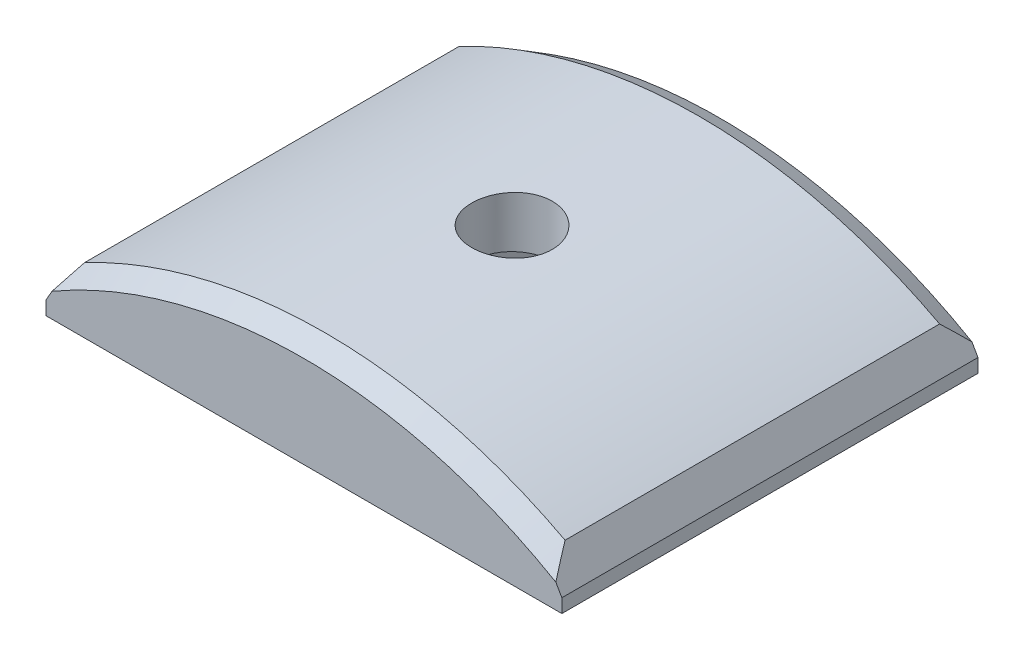
ISO-10303-21;
HEADER;
FILE_DESCRIPTION(('STEP AP214'),'2;1');
FILE_NAME('part.step','',(''),(''),'','','');
FILE_SCHEMA(('AUTOMOTIVE_DESIGN { 1 0 10303 214 1 1 1 1 }'));
ENDSEC;
DATA;
#1=APPLICATION_CONTEXT('core data for automotive mechanical design processes');
#2=APPLICATION_PROTOCOL_DEFINITION('international standard','automotive_design',2000,#1);
#3=PRODUCT_CONTEXT('',#1,'mechanical');
#4=PRODUCT('Part','Part','',(#3));
#5=PRODUCT_RELATED_PRODUCT_CATEGORY('part','',(#4));
#6=PRODUCT_DEFINITION_FORMATION('','',#4);
#7=PRODUCT_DEFINITION_CONTEXT('part definition',#1,'design');
#8=PRODUCT_DEFINITION('design','',#6,#7);
#9=PRODUCT_DEFINITION_SHAPE('','',#8);
#10=(LENGTH_UNIT() NAMED_UNIT(*) SI_UNIT(.MILLI.,.METRE.));
#11=(NAMED_UNIT(*) PLANE_ANGLE_UNIT() SI_UNIT($,.RADIAN.));
#12=(NAMED_UNIT(*) SI_UNIT($,.STERADIAN.) SOLID_ANGLE_UNIT());
#13=UNCERTAINTY_MEASURE_WITH_UNIT(LENGTH_MEASURE(1.E-05),#10,'distance_accuracy_value','');
#14=(GEOMETRIC_REPRESENTATION_CONTEXT(3) GLOBAL_UNCERTAINTY_ASSIGNED_CONTEXT((#13)) GLOBAL_UNIT_ASSIGNED_CONTEXT((#10,
#11,#12)) REPRESENTATION_CONTEXT('',''));
#15=CARTESIAN_POINT('',(0.,0.,0.));
#16=DIRECTION('',(0.,0.,1.));
#17=DIRECTION('',(1.,0.,0.));
#18=AXIS2_PLACEMENT_3D('',#15,#16,#17);
#19=CARTESIAN_POINT('',(-307.778329294272,-12.7504413816967,-12.6999999999962));
#20=DIRECTION('',(0.,-1.,0.));
#21=DIRECTION('',(0.,0.,-1.));
#22=AXIS2_PLACEMENT_3D('',#19,#20,#21);
#23=CYLINDRICAL_SURFACE('',#22,2.45744999999997);
#24=CARTESIAN_POINT('',(-307.778329294273,-6.40044138169676,-15.1574499999965));
#25=CARTESIAN_POINT('',(-307.916138462535,-6.40044264831557,-15.1574439684538));
#26=CARTESIAN_POINT('',(-308.054042153419,-6.40135957011562,-15.1458188998225));
#27=CARTESIAN_POINT('',(-308.326036047126,-6.40492919589915,-15.0996142307626));
#28=CARTESIAN_POINT('',(-308.460121716029,-6.40758388055861,-15.0650084365969));
#29=CARTESIAN_POINT('',(-308.720500741236,-6.414328954214,-14.973847389749));
#30=CARTESIAN_POINT('',(-308.846798382897,-6.41841854521409,-14.917304335212));
#31=CARTESIAN_POINT('',(-309.088079133962,-6.42757445291052,-14.7838951182316));
#32=CARTESIAN_POINT('',(-309.203064701122,-6.43264055673051,-14.707033383835));
#33=CARTESIAN_POINT('',(-309.418749452225,-6.44319362169789,-14.5349795580955));
#34=CARTESIAN_POINT('',(-309.519419423301,-6.44868140918841,-14.4397508933298));
#35=CARTESIAN_POINT('',(-309.703364847281,-6.45945237133538,-14.233743339676));
#36=CARTESIAN_POINT('',(-309.786639546153,-6.46473553711403,-14.1229637770511));
#37=CARTESIAN_POINT('',(-309.933527731891,-6.4745081640677,-13.8888243905274));
#38=CARTESIAN_POINT('',(-309.997115820092,-6.47899659675067,-13.7654485860785));
#39=CARTESIAN_POINT('',(-310.102663464834,-6.48666243855073,-13.5097304315342));
#40=CARTESIAN_POINT('',(-310.14462336375,-6.48983986842088,-13.3773882234147));
#41=CARTESIAN_POINT('',(-310.205639513845,-6.49451722826696,-13.1077845795239));
#42=CARTESIAN_POINT('',(-310.224743017592,-6.49602061864961,-12.9705338988727));
#43=CARTESIAN_POINT('',(-310.239650049525,-6.49719070353993,-12.694766492847));
#44=CARTESIAN_POINT('',(-310.235453969131,-6.49685742890254,-12.55624978878));
#45=CARTESIAN_POINT('',(-310.203920032069,-6.4943949761053,-12.2822056447876));
#46=CARTESIAN_POINT('',(-310.176633469457,-6.49226977862699,-12.1466722617558));
#47=CARTESIAN_POINT('',(-310.099772790542,-6.48646919617225,-11.8821151625203));
#48=CARTESIAN_POINT('',(-310.050198478663,-6.48279379759266,-11.7530915034511));
#49=CARTESIAN_POINT('',(-309.930111890472,-6.4743023721977,-11.5050525354933));
#50=CARTESIAN_POINT('',(-309.859576533465,-6.46948508921615,-11.3860484457335));
#51=CARTESIAN_POINT('',(-309.699586752881,-6.45925388688852,-11.1615493816845));
#52=CARTESIAN_POINT('',(-309.610131991082,-6.45383995687703,-11.0560546489559));
#53=CARTESIAN_POINT('',(-309.414554682257,-6.44300779704866,-10.8612706103805));
#54=CARTESIAN_POINT('',(-309.30838777859,-6.43758959509871,-10.7720258341987));
#55=CARTESIAN_POINT('',(-309.082554818678,-6.4273733699257,-10.6126191169969));
#56=CARTESIAN_POINT('',(-308.962888754721,-6.42257534705691,-10.5424571868782));
#57=CARTESIAN_POINT('',(-308.713425917957,-6.41413933723251,-10.4232108346725));
#58=CARTESIAN_POINT('',(-308.583628234701,-6.41050145467933,-10.3741283094089));
#59=CARTESIAN_POINT('',(-308.317599598269,-6.40479686682158,-10.2984648372469));
#60=CARTESIAN_POINT('',(-308.181368763225,-6.40273013267833,-10.2718834773351));
#61=CARTESIAN_POINT('',(-307.906726989418,-6.40040441405388,-10.2420325402269));
#62=CARTESIAN_POINT('',(-307.768322776238,-6.40014065873522,-10.2387014403444));
#63=CARTESIAN_POINT('',(-307.492923748765,-6.40143788805309,-10.2552845235165));
#64=CARTESIAN_POINT('',(-307.355928922875,-6.40299885766226,-10.275198515138));
#65=CARTESIAN_POINT('',(-307.08741231328,-6.40776687342329,-10.3376555176446));
#66=CARTESIAN_POINT('',(-306.955883874537,-6.41097185060179,-10.380170088279));
#67=CARTESIAN_POINT('',(-306.701827693505,-6.41866770756188,-10.4865924126022));
#68=CARTESIAN_POINT('',(-306.579300077562,-6.42315860538981,-10.550500466525));
#69=CARTESIAN_POINT('',(-306.34644320573,-6.4329344616574,-10.6980507804447));
#70=CARTESIAN_POINT('',(-306.236139901403,-6.43822105529525,-10.7817338859605));
#71=CARTESIAN_POINT('',(-306.031124533826,-6.44898858829396,-10.9663997262575));
#72=CARTESIAN_POINT('',(-305.936412710272,-6.45446953064107,-11.0673827269509));
#73=CARTESIAN_POINT('',(-305.765058480921,-6.46502207526093,-11.2840483906986));
#74=CARTESIAN_POINT('',(-305.688456160967,-6.47009275339518,-11.3997628076353));
#75=CARTESIAN_POINT('',(-305.555770073575,-6.47923792612701,-11.6424481428093));
#76=CARTESIAN_POINT('',(-305.499686121674,-6.48331242968029,-11.7694189598366));
#77=CARTESIAN_POINT('',(-305.409697373103,-6.48999898014987,-12.0308697420282));
#78=CARTESIAN_POINT('',(-305.375767855879,-6.49261265662817,-12.1653411552542));
#79=CARTESIAN_POINT('',(-305.330970558117,-6.49608723554373,-12.4380935237894));
#80=CARTESIAN_POINT('',(-305.320102391531,-6.49694816732195,-12.5763744152886));
#81=CARTESIAN_POINT('',(-305.321740543319,-6.49681941873413,-12.8524220557571));
#82=CARTESIAN_POINT('',(-305.334183870757,-6.49583472550311,-12.9901891852514));
#83=CARTESIAN_POINT('',(-305.381960636956,-6.49213626692947,-13.261670805154));
#84=CARTESIAN_POINT('',(-305.417294112612,-6.48942249879988,-13.3953852890296));
#85=CARTESIAN_POINT('',(-305.509832650396,-6.48257296346104,-13.6549713652521));
#86=CARTESIAN_POINT('',(-305.567036784873,-6.47843725656444,-13.7808432899799));
#87=CARTESIAN_POINT('',(-305.701685489471,-6.46920977392602,-14.021206704363));
#88=CARTESIAN_POINT('',(-305.779129687675,-6.46411801575245,-14.1356984030804));
#89=CARTESIAN_POINT('',(-305.952296421366,-6.45353585162871,-14.3503733097783));
#90=CARTESIAN_POINT('',(-306.048065423469,-6.44804445472597,-14.4505189863979));
#91=CARTESIAN_POINT('',(-306.25508254289,-6.43729074401063,-14.6333527053164));
#92=CARTESIAN_POINT('',(-306.366334410644,-6.4320284861094,-14.7160365055454));
#93=CARTESIAN_POINT('',(-306.601350095979,-6.42231757743482,-14.8616967667035));
#94=CARTESIAN_POINT('',(-306.725134786417,-6.41787031979795,-14.9246396112898));
#95=CARTESIAN_POINT('',(-306.981464486315,-6.41030731193702,-15.0287681906817));
#96=CARTESIAN_POINT('',(-307.113999175282,-6.4071900243229,-15.06997905983));
#97=CARTESIAN_POINT('',(-307.335824518077,-6.40344285805729,-15.1189211902724));
#98=CARTESIAN_POINT('',(-307.423686551372,-6.40232239610858,-15.1333504285645));
#99=CARTESIAN_POINT('',(-307.600462362014,-6.40082124999056,-15.1526167690114));
#100=CARTESIAN_POINT('',(-307.689376136939,-6.40044056411878,-15.1574538932408));
#101=CARTESIAN_POINT('',(-307.778329294273,-6.40044138169676,-15.1574499999965));
#102=B_SPLINE_CURVE_WITH_KNOTS('',3,(#24,#25,#26,#27,#28,#29,#30,#31,#32,#33,#34,#35,#36,#37,
#38,#39,#40,#41,#42,#43,#44,#45,#46,#47,#48,#49,#50,#51,#52,#53,#54,#55,#56,#57,#58,#59,#60,#61,
#62,#63,#64,#65,#66,#67,#68,#69,#70,#71,#72,#73,#74,#75,#76,#77,#78,#79,#80,#81,#82,#83,#84,#85,
#86,#87,#88,#89,#90,#91,#92,#93,#94,#95,#96,#97,#98,#99,#100,#101),.UNSPECIFIED.,.T.,.F.,(4,2,2,
2,2,2,2,2,2,2,2,2,2,2,2,2,2,2,2,2,2,2,2,2,2,2,2,2,2,2,2,2,2,2,2,2,2,2,4),(0.,0.413102740448948,
0.826677150949451,1.24002192352069,1.65327669008709,2.06736301449678,2.48146728457903,
2.89610360577944,3.31073336306802,3.72450443892585,4.13826856368236,4.55111594304941,
4.96396694526592,5.37727424252109,5.79058892908474,6.20501971204393,6.61945073174935,
7.03391903608624,7.44837973260893,7.86174330440357,8.27510347200056,8.68794470004393,
9.1007917220996,9.51449905350705,9.92821274446887,10.3428338016938,10.7574511313046,
11.1716050247776,11.5857519852537,11.9987814761939,12.4118116328692,12.8248242727058,
13.2378293238306,13.6518958626282,14.0660628765239,14.480931382368,14.8953190094935,
15.1619694660395,15.4286193089313),.UNSPECIFIED.);
#103=CARTESIAN_POINT('',(-307.778329294273,-6.40044138169676,-15.1574499999965));
#104=VERTEX_POINT('',#103);
#105=EDGE_CURVE('E214',#104,#104,#102,.T.);
#106=ORIENTED_EDGE('',*,*,#105,.T.);
#107=EDGE_LOOP('',(#106));
#108=FACE_BOUND('',#107,.T.);
#109=CARTESIAN_POINT('',(-307.778329294272,-9.57544138169669,-12.6999999999962));
#110=DIRECTION('',(0.,-1.,0.));
#111=DIRECTION('',(0.,0.,-1.));
#112=AXIS2_PLACEMENT_3D('',#109,#110,#111);
#113=CIRCLE('',#112,2.45744999999997);
#114=CARTESIAN_POINT('',(-307.778329294272,-9.57544138169669,-15.1574499999961));
#115=VERTEX_POINT('',#114);
#116=EDGE_CURVE('E39',#115,#115,#113,.F.);
#117=ORIENTED_EDGE('',*,*,#116,.F.);
#118=EDGE_LOOP('',(#117));
#119=FACE_BOUND('',#118,.T.);
#120=ADVANCED_FACE('F34',(#108,#119),#23,.F.);
#121=CARTESIAN_POINT('',(-307.778329294268,-37.7567413816972,-63.7657730275278));
#122=DIRECTION('',(0.,0.,1.));
#123=DIRECTION('',(1.00000000000005,0.,0.));
#124=AXIS2_PLACEMENT_3D('',#121,#122,#123);
#125=CYLINDRICAL_SURFACE('',#124,31.3563);
#126=CARTESIAN_POINT('',(-307.778329294267,-37.7567413816974,-1.26999999999811));
#127=DIRECTION('',(0.,0.,1.));
#128=DIRECTION('',(1.00000000000005,0.,0.));
#129=AXIS2_PLACEMENT_3D('',#126,#127,#128);
#130=CIRCLE('',#129,31.3563);
#131=CARTESIAN_POINT('',(-322.443081649602,-10.0409951704381,-1.26999999999811));
#132=VERTEX_POINT('',#131);
#133=CARTESIAN_POINT('',(-293.10937478227,-10.0432189925299,-1.26999999999766));
#134=VERTEX_POINT('',#133);
#135=EDGE_CURVE('E329',#132,#134,#130,.F.);
#136=ORIENTED_EDGE('',*,*,#135,.T.);
#137=DIRECTION('',(0.,0.,1.));
#138=VECTOR('',#137,1.);
#139=CARTESIAN_POINT('',(-293.109374782271,-10.043218992531,-63.7657730275276));
#140=LINE('',#139,#138);
#141=CARTESIAN_POINT('',(-293.109374782272,-10.0432189925305,-24.129999999996));
#142=VERTEX_POINT('',#141);
#143=EDGE_CURVE('E275',#134,#142,#140,.F.);
#144=ORIENTED_EDGE('',*,*,#143,.T.);
#145=CARTESIAN_POINT('',(-307.778329294269,-37.7567413816971,-24.1299999999975));
#146=DIRECTION('',(0.,0.,1.));
#147=DIRECTION('',(1.00000000000005,0.,0.));
#148=AXIS2_PLACEMENT_3D('',#145,#146,#147);
#149=CIRCLE('',#148,31.3563);
#150=CARTESIAN_POINT('',(-322.443081649602,-10.0409951704382,-24.1299999999973));
#151=VERTEX_POINT('',#150);
#152=EDGE_CURVE('E279',#142,#151,#149,.T.);
#153=ORIENTED_EDGE('',*,*,#152,.T.);
#154=DIRECTION('',(0.,0.,1.));
#155=VECTOR('',#154,1.);
#156=CARTESIAN_POINT('',(-322.443081649602,-10.0409951704377,-63.7657730275285));
#157=LINE('',#156,#155);
#158=EDGE_CURVE('E327',#151,#132,#157,.T.);
#159=ORIENTED_EDGE('',*,*,#158,.T.);
#160=EDGE_LOOP('',(#136,#144,#153,#159));
#161=FACE_BOUND('',#160,.T.);
#162=ORIENTED_EDGE('',*,*,#105,.F.);
#163=EDGE_LOOP('',(#162));
#164=FACE_BOUND('',#163,.T.);
#165=ADVANCED_FACE('F224',(#161,#164),#125,.T.);
#166=CARTESIAN_POINT('',(-288.860017794565,-12.750441381697,-63.7657730275278));
#167=DIRECTION('',(0.,-1.,0.));
#168=DIRECTION('',(0.,0.,-1.));
#169=AXIS2_PLACEMENT_3D('',#166,#167,#168);
#170=PLANE('',#169);
#171=DIRECTION('',(0.500000000000025,0.,-0.86602540378444));
#172=VECTOR('',#171,1.);
#173=CARTESIAN_POINT('',(-313.057620155743,-12.7504413816971,-12.699999999997));
#174=LINE('',#173,#172);
#175=CARTESIAN_POINT('',(-313.057620155743,-12.7504413816971,-12.699999999997));
#176=VERTEX_POINT('',#175);
#177=CARTESIAN_POINT('',(-310.417974725007,-12.750441381697,-17.2719999999966));
#178=VERTEX_POINT('',#177);
#179=EDGE_CURVE('E52',#176,#178,#174,.T.);
#180=ORIENTED_EDGE('',*,*,#179,.F.);
#181=DIRECTION('',(-0.500000000000022,0.,-0.866025403784435));
#182=VECTOR('',#181,1.);
#183=CARTESIAN_POINT('',(-310.417974725008,-12.7504413816974,-8.12799999999658));
#184=LINE('',#183,#182);
#185=CARTESIAN_POINT('',(-310.417974725008,-12.7504413816974,-8.12799999999658));
#186=VERTEX_POINT('',#185);
#187=EDGE_CURVE('E159',#186,#176,#184,.T.);
#188=ORIENTED_EDGE('',*,*,#187,.F.);
#189=DIRECTION('',(-1.00000000000004,0.,0.));
#190=VECTOR('',#189,1.);
#191=CARTESIAN_POINT('',(-305.138683863538,-12.7504413816967,-8.12799999999703));
#192=LINE('',#191,#190);
#193=CARTESIAN_POINT('',(-305.138683863538,-12.7504413816967,-8.12799999999703));
#194=VERTEX_POINT('',#193);
#195=EDGE_CURVE('E162',#194,#186,#192,.T.);
#196=ORIENTED_EDGE('',*,*,#195,.F.);
#197=DIRECTION('',(-0.500000000000025,0.,0.866025403784439));
#198=VECTOR('',#197,1.);
#199=CARTESIAN_POINT('',(-302.499038432801,-12.7504413816962,-12.6999999999975));
#200=LINE('',#199,#198);
#201=CARTESIAN_POINT('',(-302.499038432801,-12.7504413816962,-12.6999999999975));
#202=VERTEX_POINT('',#201);
#203=EDGE_CURVE('E178',#202,#194,#200,.T.);
#204=ORIENTED_EDGE('',*,*,#203,.F.);
#205=DIRECTION('',(0.500000000000021,0.,0.866025403784438));
#206=VECTOR('',#205,1.);
#207=CARTESIAN_POINT('',(-305.138683863537,-12.7504413816962,-17.2719999999973));
#208=LINE('',#207,#206);
#209=CARTESIAN_POINT('',(-305.138683863537,-12.7504413816962,-17.2719999999973));
#210=VERTEX_POINT('',#209);
#211=EDGE_CURVE('E175',#210,#202,#208,.T.);
#212=ORIENTED_EDGE('',*,*,#211,.F.);
#213=DIRECTION('',(1.00000000000004,0.,0.));
#214=VECTOR('',#213,1.);
#215=CARTESIAN_POINT('',(-310.417974725007,-12.750441381697,-17.2719999999966));
#216=LINE('',#215,#214);
#217=EDGE_CURVE('E173',#178,#210,#216,.T.);
#218=ORIENTED_EDGE('',*,*,#217,.F.);
#219=EDGE_LOOP('',(#180,#188,#196,#204,#212,#218));
#220=FACE_BOUND('',#219,.T.);
#221=DIRECTION('',(0.,0.,1.));
#222=VECTOR('',#221,1.);
#223=CARTESIAN_POINT('',(-292.035017794562,-12.750441381697,-25.4009999999976));
#224=LINE('',#223,#222);
#225=CARTESIAN_POINT('',(-292.035017794564,-12.750441381697,-25.3999999999968));
#226=VERTEX_POINT('',#225);
#227=CARTESIAN_POINT('',(-292.035017794564,-12.7504413816962,3.10862446895044E-12));
#228=VERTEX_POINT('',#227);
#229=EDGE_CURVE('E198',#226,#228,#224,.T.);
#230=ORIENTED_EDGE('',*,*,#229,.T.);
#231=DIRECTION('',(1.00000000000005,0.,0.));
#232=VECTOR('',#231,1.);
#233=CARTESIAN_POINT('',(-288.860017794563,-12.7504413816974,3.99680288865056E-12));
#234=LINE('',#233,#232);
#235=CARTESIAN_POINT('',(-323.521640793984,-12.7504413816969,3.77475828372553E-12));
#236=VERTEX_POINT('',#235);
#237=EDGE_CURVE('E201',#236,#228,#234,.T.);
#238=ORIENTED_EDGE('',*,*,#237,.F.);
#239=DIRECTION('',(0.,0.,1.));
#240=VECTOR('',#239,1.);
#241=CARTESIAN_POINT('',(-323.521640793981,-12.7504413816967,-25.4009999999982));
#242=LINE('',#241,#240);
#243=CARTESIAN_POINT('',(-323.521640793982,-12.7504413816967,-25.3999999999963));
#244=VERTEX_POINT('',#243);
#245=EDGE_CURVE('E196',#244,#236,#242,.T.);
#246=ORIENTED_EDGE('',*,*,#245,.F.);
#247=DIRECTION('',(-1.00000000000004,0.,0.));
#248=VECTOR('',#247,1.);
#249=CARTESIAN_POINT('',(-288.860017794565,-12.7504413816962,-25.3999999999959));
#250=LINE('',#249,#248);
#251=EDGE_CURVE('E211',#226,#244,#250,.T.);
#252=ORIENTED_EDGE('',*,*,#251,.F.);
#253=EDGE_LOOP('',(#230,#238,#246,#252));
#254=FACE_BOUND('',#253,.T.);
#255=ADVANCED_FACE('F247',(#220,#254),#170,.T.);
#256=CARTESIAN_POINT('',(-307.778329294268,-37.7567413816974,1.77635683940025E-12));
#257=DIRECTION('',(0.,0.,1.));
#258=DIRECTION('',(1.00000000000005,0.,0.));
#259=AXIS2_PLACEMENT_3D('',#256,#257,#258);
#260=PLANE('',#259);
#261=DIRECTION('',(0.,-1.,0.));
#262=VECTOR('',#261,1.);
#263=CARTESIAN_POINT('',(-292.035017794564,-12.7504413816962,3.10862446895044E-12));
#264=LINE('',#263,#262);
#265=CARTESIAN_POINT('',(-292.035017794564,-11.9144221928847,3.10862446895044E-12));
#266=VERTEX_POINT('',#265);
#267=EDGE_CURVE('E195',#266,#228,#264,.T.);
#268=ORIENTED_EDGE('',*,*,#267,.F.);
#269=DIRECTION('',(0.497919017874347,-0.867223530376722,0.));
#270=VECTOR('',#269,1.);
#271=CARTESIAN_POINT('',(-284.779255686266,-24.5517535766,2.22044604925031E-12));
#272=LINE('',#271,#270);
#273=CARTESIAN_POINT('',(-292.403158950186,-11.273232237904,2.22044604925031E-12));
#274=VERTEX_POINT('',#273);
#275=EDGE_CURVE('E330',#266,#274,#272,.F.);
#276=ORIENTED_EDGE('',*,*,#275,.T.);
#277=CARTESIAN_POINT('',(-307.778329294268,-37.7567413816974,1.77635683940025E-12));
#278=DIRECTION('',(0.,0.,1.));
#279=DIRECTION('',(1.00000000000005,0.,0.));
#280=AXIS2_PLACEMENT_3D('',#277,#278,#279);
#281=CIRCLE('',#280,30.6230651581292);
#282=CARTESIAN_POINT('',(-323.155025546841,-11.2741181725934,2.66453525910038E-12));
#283=VERTEX_POINT('',#282);
#284=EDGE_CURVE('E335',#274,#283,#281,.T.);
#285=ORIENTED_EDGE('',*,*,#284,.T.);
#286=DIRECTION('',(0.499999999999969,0.866025403784471,0.));
#287=VECTOR('',#286,1.);
#288=CARTESIAN_POINT('',(-330.778163712665,-24.4777807889236,2.88657986402541E-12));
#289=LINE('',#288,#287);
#290=CARTESIAN_POINT('',(-323.521640793984,-11.9091144074732,3.77475828372553E-12));
#291=VERTEX_POINT('',#290);
#292=EDGE_CURVE('E264',#283,#291,#289,.F.);
#293=ORIENTED_EDGE('',*,*,#292,.T.);
#294=DIRECTION('',(0.,1.,0.));
#295=VECTOR('',#294,1.);
#296=CARTESIAN_POINT('',(-323.521640793984,-12.7504413816969,3.77475828372553E-12));
#297=LINE('',#296,#295);
#298=EDGE_CURVE('E204',#236,#291,#297,.T.);
#299=ORIENTED_EDGE('',*,*,#298,.F.);
#300=ORIENTED_EDGE('',*,*,#237,.T.);
#301=EDGE_LOOP('',(#268,#276,#285,#293,#299,#300));
#302=FACE_BOUND('',#301,.T.);
#303=ADVANCED_FACE('F245',(#302),#260,.T.);
#304=CARTESIAN_POINT('',(-326.828329294275,-74.2702413816967,-25.3999999999974));
#305=DIRECTION('',(0.,0.,1.));
#306=DIRECTION('',(-1.00000000000004,0.,0.));
#307=AXIS2_PLACEMENT_3D('',#304,#305,#306);
#308=PLANE('',#307);
#309=CARTESIAN_POINT('',(-307.778329294268,-37.7567413816971,-25.3999999999974));
#310=DIRECTION('',(0.,0.,1.));
#311=DIRECTION('',(1.00000000000004,0.,0.));
#312=AXIS2_PLACEMENT_3D('',#309,#310,#311);
#313=CIRCLE('',#312,30.6230651581292);
#314=CARTESIAN_POINT('',(-323.15502554684,-11.2741181725934,-25.3999999999963));
#315=VERTEX_POINT('',#314);
#316=CARTESIAN_POINT('',(-292.403158950186,-11.2732322379047,-25.3999999999957));
#317=VERTEX_POINT('',#316);
#318=EDGE_CURVE('E60',#315,#317,#313,.F.);
#319=ORIENTED_EDGE('',*,*,#318,.T.);
#320=DIRECTION('',(-0.497919017874348,0.867223530376722,0.));
#321=VECTOR('',#320,1.);
#322=CARTESIAN_POINT('',(-292.035017794564,-11.9144221928854,-25.3999999999968));
#323=LINE('',#322,#321);
#324=CARTESIAN_POINT('',(-292.035017794564,-11.9144221928855,-25.3999999999968));
#325=VERTEX_POINT('',#324);
#326=EDGE_CURVE('E44',#317,#325,#323,.F.);
#327=ORIENTED_EDGE('',*,*,#326,.T.);
#328=DIRECTION('',(0.,1.,0.));
#329=VECTOR('',#328,1.);
#330=CARTESIAN_POINT('',(-292.035017794564,-12.750441381697,-25.3999999999968));
#331=LINE('',#330,#329);
#332=EDGE_CURVE('E192',#226,#325,#331,.T.);
#333=ORIENTED_EDGE('',*,*,#332,.F.);
#334=ORIENTED_EDGE('',*,*,#251,.T.);
#335=DIRECTION('',(0.,-1.,0.));
#336=VECTOR('',#335,1.);
#337=CARTESIAN_POINT('',(-323.521640793982,-12.7504413816967,-25.3999999999963));
#338=LINE('',#337,#336);
#339=CARTESIAN_POINT('',(-323.521640793982,-11.9091144074731,-25.3999999999963));
#340=VERTEX_POINT('',#339);
#341=EDGE_CURVE('E202',#340,#244,#338,.T.);
#342=ORIENTED_EDGE('',*,*,#341,.F.);
#343=DIRECTION('',(-0.499999999999969,-0.866025403784471,0.));
#344=VECTOR('',#343,1.);
#345=CARTESIAN_POINT('',(-322.443081649602,-10.0409951704382,-25.3999999999963));
#346=LINE('',#345,#344);
#347=EDGE_CURVE('E272',#340,#315,#346,.F.);
#348=ORIENTED_EDGE('',*,*,#347,.T.);
#349=EDGE_LOOP('',(#319,#327,#333,#334,#342,#348));
#350=FACE_BOUND('',#349,.T.);
#351=ADVANCED_FACE('F241',(#350),#308,.F.);
#352=CARTESIAN_POINT('',(-323.521640793981,-12.7504413816967,-25.4009999999982));
#353=DIRECTION('',(1.00000000000005,0.,0.));
#354=DIRECTION('',(0.,1.,0.));
#355=AXIS2_PLACEMENT_3D('',#352,#353,#354);
#356=PLANE('',#355);
#357=ORIENTED_EDGE('',*,*,#298,.T.);
#358=DIRECTION('',(0.,0.,-1.));
#359=VECTOR('',#358,1.);
#360=CARTESIAN_POINT('',(-323.521640793982,-11.9091144074731,-25.3999999999963));
#361=LINE('',#360,#359);
#362=EDGE_CURVE('E11',#291,#340,#361,.T.);
#363=ORIENTED_EDGE('',*,*,#362,.T.);
#364=ORIENTED_EDGE('',*,*,#341,.T.);
#365=ORIENTED_EDGE('',*,*,#245,.T.);
#366=EDGE_LOOP('',(#357,#363,#364,#365));
#367=FACE_BOUND('',#366,.T.);
#368=ADVANCED_FACE('F237',(#367),#356,.F.);
#369=CARTESIAN_POINT('',(-292.035017794562,-12.750441381697,-25.4009999999976));
#370=DIRECTION('',(-1.00000000000005,0.,0.));
#371=DIRECTION('',(0.,-1.,0.));
#372=AXIS2_PLACEMENT_3D('',#369,#370,#371);
#373=PLANE('',#372);
#374=ORIENTED_EDGE('',*,*,#332,.T.);
#375=DIRECTION('',(0.,0.,1.));
#376=VECTOR('',#375,1.);
#377=CARTESIAN_POINT('',(-292.035017794564,-11.9144221928847,3.10862446895044E-12));
#378=LINE('',#377,#376);
#379=EDGE_CURVE('E222',#325,#266,#378,.T.);
#380=ORIENTED_EDGE('',*,*,#379,.T.);
#381=ORIENTED_EDGE('',*,*,#267,.T.);
#382=ORIENTED_EDGE('',*,*,#229,.F.);
#383=EDGE_LOOP('',(#374,#380,#381,#382));
#384=FACE_BOUND('',#383,.T.);
#385=ADVANCED_FACE('F234',(#384),#373,.F.);
#386=CARTESIAN_POINT('',(-322.443081649602,-10.0409951704377,-63.7657730275285));
#387=DIRECTION('',(0.866025403784509,-0.499999999999945,0.));
#388=DIRECTION('',(0.,0.,1.));
#389=AXIS2_PLACEMENT_3D('',#386,#387,#388);
#390=PLANE('',#389);
#391=CARTESIAN_POINT('',(-322.443081649602,-10.0409951704381,-1.26999999999811));
#392=CARTESIAN_POINT('',(-322.501567822102,-10.1422961927488,-1.16228982232931));
#393=CARTESIAN_POINT('',(-322.560256499535,-10.2439479638911,-1.0550189036183));
#394=CARTESIAN_POINT('',(-322.678047780389,-10.4479684470194,-0.841405850914965));
#395=CARTESIAN_POINT('',(-322.737150356109,-10.5503371110245,-0.73506365581464));
#396=CARTESIAN_POINT('',(-322.855786272448,-10.7558205457261,-0.523343718287577));
#397=CARTESIAN_POINT('',(-322.915319614306,-10.8589353185698,-0.417965978638359));
#398=CARTESIAN_POINT('',(-323.034834232014,-11.0659407086863,-0.208215549761757));
#399=CARTESIAN_POINT('',(-323.094815537303,-11.1698313769499,-0.103842927639765));
#400=CARTESIAN_POINT('',(-323.155025546841,-11.2741181725934,2.66453525910038E-12));
#401=B_SPLINE_CURVE_WITH_KNOTS('',3,(#391,#392,#393,#394,#395,#396,#397,#398,#399,#400),
.UNSPECIFIED.,.F.,.F.,(4,2,2,2,4),(0.,0.477027853972129,0.954024080416573,1.43102168012252,
1.90805090820572),.UNSPECIFIED.);
#402=EDGE_CURVE('E314',#132,#283,#401,.T.);
#403=ORIENTED_EDGE('',*,*,#402,.F.);
#404=ORIENTED_EDGE('',*,*,#158,.F.);
#405=CARTESIAN_POINT('',(-322.443081649602,-10.0409951704382,-24.1299999999973));
#406=CARTESIAN_POINT('',(-322.501567822102,-10.1422961927485,-24.2377101776665));
#407=CARTESIAN_POINT('',(-322.560256499534,-10.2439479638907,-24.3449810963776));
#408=CARTESIAN_POINT('',(-322.678047780389,-10.4479684470188,-24.5585941490808));
#409=CARTESIAN_POINT('',(-322.737150356109,-10.5503371110239,-24.664936344181));
#410=CARTESIAN_POINT('',(-322.855786272447,-10.7558205457253,-24.876656281708));
#411=CARTESIAN_POINT('',(-322.915319614306,-10.8589353185688,-24.9820340213572));
#412=CARTESIAN_POINT('',(-323.034834232014,-11.0659407086854,-25.1917844502334));
#413=CARTESIAN_POINT('',(-323.094815537302,-11.1698313769492,-25.2961570723549));
#414=CARTESIAN_POINT('',(-323.155025546841,-11.2741181725934,-25.3999999999963));
#415=B_SPLINE_CURVE_WITH_KNOTS('',3,(#405,#406,#407,#408,#409,#410,#411,#412,#413,#414),
.UNSPECIFIED.,.F.,.F.,(4,2,2,2,4),(0.,0.477027853971792,0.954024080415859,1.43102168012144,
1.90805090820429),.UNSPECIFIED.);
#416=EDGE_CURVE('E205',#315,#151,#415,.F.);
#417=ORIENTED_EDGE('',*,*,#416,.F.);
#418=ORIENTED_EDGE('',*,*,#347,.F.);
#419=ORIENTED_EDGE('',*,*,#362,.F.);
#420=ORIENTED_EDGE('',*,*,#292,.F.);
#421=EDGE_LOOP('',(#403,#404,#417,#418,#419,#420));
#422=FACE_BOUND('',#421,.T.);
#423=ADVANCED_FACE('F36',(#422),#390,.F.);
#424=CARTESIAN_POINT('',(-307.778329294268,-37.7567413816971,-25.3999999999974));
#425=DIRECTION('',(0.,0.,1.));
#426=DIRECTION('',(1.00000000000005,0.,0.));
#427=AXIS2_PLACEMENT_3D('',#424,#425,#426);
#428=CONICAL_SURFACE('',#427,30.6230651581291,0.523598775598297);
#429=ORIENTED_EDGE('',*,*,#416,.T.);
#430=ORIENTED_EDGE('',*,*,#152,.F.);
#431=CARTESIAN_POINT('',(-293.109374782272,-10.0432189925305,-24.129999999996));
#432=CARTESIAN_POINT('',(-293.051353951067,-10.1442736384994,-24.2376840624565));
#433=CARTESIAN_POINT('',(-292.993133500994,-10.245675959841,-24.3449348603568));
#434=CARTESIAN_POINT('',(-292.876284527261,-10.4491913426306,-24.5585205710248));
#435=CARTESIAN_POINT('',(-292.817656030357,-10.5513043574806,-24.6648555428364));
#436=CARTESIAN_POINT('',(-292.699974426526,-10.756269928731,-24.8765745449424));
#437=CARTESIAN_POINT('',(-292.640921318403,-10.8591224872134,-24.9819585725578));
#438=CARTESIAN_POINT('',(-292.522373621362,-11.0655965294882,-25.1917358046547));
#439=CARTESIAN_POINT('',(-292.462879004011,-11.169218062801,-25.2961289443213));
#440=CARTESIAN_POINT('',(-292.403158950186,-11.2732322379047,-25.3999999999957));
#441=B_SPLINE_CURVE_WITH_KNOTS('',3,(#431,#432,#433,#434,#435,#436,#437,#438,#439,#440),
.UNSPECIFIED.,.F.,.F.,(4,2,2,2,4),(0.,0.475991930757413,0.951952940720686,1.42791529114378,
1.90390856318368),.UNSPECIFIED.);
#442=EDGE_CURVE('E292',#317,#142,#441,.F.);
#443=ORIENTED_EDGE('',*,*,#442,.F.);
#444=ORIENTED_EDGE('',*,*,#318,.F.);
#445=EDGE_LOOP('',(#429,#430,#443,#444));
#446=FACE_BOUND('',#445,.T.);
#447=ADVANCED_FACE('F304',(#446),#428,.T.);
#448=CARTESIAN_POINT('',(-307.778329294268,-37.7567413816974,1.77635683940025E-12));
#449=DIRECTION('',(0.,0.,-1.));
#450=DIRECTION('',(-1.00000000000005,0.,0.));
#451=AXIS2_PLACEMENT_3D('',#448,#449,#450);
#452=CONICAL_SURFACE('',#451,30.6230651581292,0.523598775598295);
#453=ORIENTED_EDGE('',*,*,#402,.T.);
#454=ORIENTED_EDGE('',*,*,#284,.F.);
#455=CARTESIAN_POINT('',(-292.403158950186,-11.273232237904,2.22044604925031E-12));
#456=CARTESIAN_POINT('',(-292.462879004011,-11.1692180628012,-0.103871055673209));
#457=CARTESIAN_POINT('',(-292.522373621362,-11.0655965294888,-0.208264195340122));
#458=CARTESIAN_POINT('',(-292.640921318403,-10.8591224872143,-0.41804142743732));
#459=CARTESIAN_POINT('',(-292.699974426525,-10.7562699287318,-0.523425455052487));
#460=CARTESIAN_POINT('',(-292.817656030356,-10.5513043574815,-0.735144457158382));
#461=CARTESIAN_POINT('',(-292.876284527261,-10.4491913426317,-0.841479428970109));
#462=CARTESIAN_POINT('',(-292.993133500993,-10.2456759598418,-1.05506513963784));
#463=CARTESIAN_POINT('',(-293.051353951066,-10.1442736384999,-1.16231593753784));
#464=CARTESIAN_POINT('',(-293.10937478227,-10.0432189925299,-1.26999999999766));
#465=B_SPLINE_CURVE_WITH_KNOTS('',3,(#455,#456,#457,#458,#459,#460,#461,#462,#463,#464),
.UNSPECIFIED.,.F.,.F.,(4,2,2,2,4),(0.,0.475993272039739,0.951955622462689,1.42791663242582,
1.90390856318308),.UNSPECIFIED.);
#466=EDGE_CURVE('E284',#134,#274,#465,.F.);
#467=ORIENTED_EDGE('',*,*,#466,.F.);
#468=ORIENTED_EDGE('',*,*,#135,.F.);
#469=EDGE_LOOP('',(#453,#454,#467,#468));
#470=FACE_BOUND('',#469,.T.);
#471=ADVANCED_FACE('F298',(#470),#452,.T.);
#472=CARTESIAN_POINT('',(-292.035017794564,-11.9144221928859,-63.7657730275269));
#473=DIRECTION('',(-0.867223530376757,-0.497919017874327,0.));
#474=DIRECTION('',(0.,0.,1.));
#475=AXIS2_PLACEMENT_3D('',#472,#473,#474);
#476=PLANE('',#475);
#477=ORIENTED_EDGE('',*,*,#442,.T.);
#478=ORIENTED_EDGE('',*,*,#143,.F.);
#479=ORIENTED_EDGE('',*,*,#466,.T.);
#480=ORIENTED_EDGE('',*,*,#275,.F.);
#481=ORIENTED_EDGE('',*,*,#379,.F.);
#482=ORIENTED_EDGE('',*,*,#326,.F.);
#483=EDGE_LOOP('',(#477,#478,#479,#480,#481,#482));
#484=FACE_BOUND('',#483,.T.);
#485=ADVANCED_FACE('F300',(#484),#476,.F.);
#486=CARTESIAN_POINT('',(0.,-9.57544138169619,0.));
#487=DIRECTION('',(0.,-1.,0.));
#488=DIRECTION('',(0.,0.,-1.));
#489=AXIS2_PLACEMENT_3D('',#486,#487,#488);
#490=PLANE('',#489);
#491=DIRECTION('',(0.500000000000025,0.,-0.86602540378444));
#492=VECTOR('',#491,1.);
#493=CARTESIAN_POINT('',(-313.057620155743,-9.57544138169703,-12.699999999997));
#494=LINE('',#493,#492);
#495=CARTESIAN_POINT('',(-313.057620155743,-9.57544138169703,-12.699999999997));
#496=VERTEX_POINT('',#495);
#497=CARTESIAN_POINT('',(-310.417974725007,-9.57544138169694,-17.2719999999966));
#498=VERTEX_POINT('',#497);
#499=EDGE_CURVE('E139',#496,#498,#494,.T.);
#500=ORIENTED_EDGE('',*,*,#499,.T.);
#501=DIRECTION('',(1.00000000000004,0.,0.));
#502=VECTOR('',#501,1.);
#503=CARTESIAN_POINT('',(-310.417974725007,-9.57544138169694,-17.2719999999966));
#504=LINE('',#503,#502);
#505=CARTESIAN_POINT('',(-305.138683863537,-9.57544138169619,-17.2719999999973));
#506=VERTEX_POINT('',#505);
#507=EDGE_CURVE('E148',#498,#506,#504,.T.);
#508=ORIENTED_EDGE('',*,*,#507,.T.);
#509=DIRECTION('',(0.500000000000021,0.,0.866025403784438));
#510=VECTOR('',#509,1.);
#511=CARTESIAN_POINT('',(-305.138683863537,-9.57544138169619,-17.2719999999973));
#512=LINE('',#511,#510);
#513=CARTESIAN_POINT('',(-302.499038432801,-9.57544138169619,-12.6999999999975));
#514=VERTEX_POINT('',#513);
#515=EDGE_CURVE('E153',#506,#514,#512,.T.);
#516=ORIENTED_EDGE('',*,*,#515,.T.);
#517=DIRECTION('',(-0.500000000000025,0.,0.866025403784439));
#518=VECTOR('',#517,1.);
#519=CARTESIAN_POINT('',(-302.499038432801,-9.57544138169619,-12.6999999999975));
#520=LINE('',#519,#518);
#521=CARTESIAN_POINT('',(-305.138683863538,-9.57544138169669,-8.12799999999703));
#522=VERTEX_POINT('',#521);
#523=EDGE_CURVE('E166',#514,#522,#520,.T.);
#524=ORIENTED_EDGE('',*,*,#523,.T.);
#525=DIRECTION('',(-1.00000000000004,0.,0.));
#526=VECTOR('',#525,1.);
#527=CARTESIAN_POINT('',(-305.138683863538,-9.57544138169669,-8.12799999999703));
#528=LINE('',#527,#526);
#529=CARTESIAN_POINT('',(-310.417974725008,-9.57544138169733,-8.12799999999658));
#530=VERTEX_POINT('',#529);
#531=EDGE_CURVE('E169',#522,#530,#528,.T.);
#532=ORIENTED_EDGE('',*,*,#531,.T.);
#533=DIRECTION('',(-0.500000000000022,0.,-0.866025403784435));
#534=VECTOR('',#533,1.);
#535=CARTESIAN_POINT('',(-310.417974725008,-9.57544138169733,-8.12799999999658));
#536=LINE('',#535,#534);
#537=EDGE_CURVE('E145',#530,#496,#536,.T.);
#538=ORIENTED_EDGE('',*,*,#537,.T.);
#539=EDGE_LOOP('',(#500,#508,#516,#524,#532,#538));
#540=FACE_BOUND('',#539,.T.);
#541=ORIENTED_EDGE('',*,*,#116,.T.);
#542=EDGE_LOOP('',(#541));
#543=FACE_BOUND('',#542,.T.);
#544=ADVANCED_FACE('F155',(#540,#543),#490,.T.);
#545=CARTESIAN_POINT('',(-313.057620155743,-9.57544138169703,-12.699999999997));
#546=DIRECTION('',(-0.866025403784473,0.,-0.499999999999992));
#547=DIRECTION('',(-0.500000000000025,0.,0.86602540378444));
#548=AXIS2_PLACEMENT_3D('',#545,#546,#547);
#549=PLANE('',#548);
#550=ORIENTED_EDGE('',*,*,#179,.T.);
#551=DIRECTION('',(0.,-1.,0.));
#552=VECTOR('',#551,1.);
#553=CARTESIAN_POINT('',(-310.417974725007,-9.57544138169694,-17.2719999999966));
#554=LINE('',#553,#552);
#555=EDGE_CURVE('E135',#498,#178,#554,.T.);
#556=ORIENTED_EDGE('',*,*,#555,.F.);
#557=ORIENTED_EDGE('',*,*,#499,.F.);
#558=DIRECTION('',(0.,-1.,0.));
#559=VECTOR('',#558,1.);
#560=CARTESIAN_POINT('',(-313.057620155743,-9.57544138169703,-12.699999999997));
#561=LINE('',#560,#559);
#562=EDGE_CURVE('E183',#496,#176,#561,.T.);
#563=ORIENTED_EDGE('',*,*,#562,.T.);
#564=EDGE_LOOP('',(#550,#556,#557,#563));
#565=FACE_BOUND('',#564,.T.);
#566=ADVANCED_FACE('F137',(#565),#549,.F.);
#567=CARTESIAN_POINT('',(-310.417974725008,-9.57544138169733,-8.12799999999658));
#568=DIRECTION('',(-0.866025403784477,0.,0.500000000000002));
#569=DIRECTION('',(0.500000000000022,0.,0.866025403784435));
#570=AXIS2_PLACEMENT_3D('',#567,#568,#569);
#571=PLANE('',#570);
#572=ORIENTED_EDGE('',*,*,#187,.T.);
#573=ORIENTED_EDGE('',*,*,#562,.F.);
#574=ORIENTED_EDGE('',*,*,#537,.F.);
#575=DIRECTION('',(0.,-1.,0.));
#576=VECTOR('',#575,1.);
#577=CARTESIAN_POINT('',(-310.417974725008,-9.57544138169733,-8.12799999999658));
#578=LINE('',#577,#576);
#579=EDGE_CURVE('E185',#530,#186,#578,.T.);
#580=ORIENTED_EDGE('',*,*,#579,.T.);
#581=EDGE_LOOP('',(#572,#573,#574,#580));
#582=FACE_BOUND('',#581,.T.);
#583=ADVANCED_FACE('F360',(#582),#571,.F.);
#584=CARTESIAN_POINT('',(-305.138683863538,-9.57544138169669,-8.12799999999703));
#585=DIRECTION('',(0.,0.,1.));
#586=DIRECTION('',(1.00000000000005,0.,0.));
#587=AXIS2_PLACEMENT_3D('',#584,#585,#586);
#588=PLANE('',#587);
#589=ORIENTED_EDGE('',*,*,#195,.T.);
#590=ORIENTED_EDGE('',*,*,#579,.F.);
#591=ORIENTED_EDGE('',*,*,#531,.F.);
#592=DIRECTION('',(0.,-1.,0.));
#593=VECTOR('',#592,1.);
#594=CARTESIAN_POINT('',(-305.138683863538,-9.57544138169669,-8.12799999999703));
#595=LINE('',#594,#593);
#596=EDGE_CURVE('E187',#522,#194,#595,.T.);
#597=ORIENTED_EDGE('',*,*,#596,.T.);
#598=EDGE_LOOP('',(#589,#590,#591,#597));
#599=FACE_BOUND('',#598,.T.);
#600=ADVANCED_FACE('F366',(#599),#588,.F.);
#601=CARTESIAN_POINT('',(-302.499038432801,-9.57544138169619,-12.6999999999975));
#602=DIRECTION('',(0.866025403784473,0.,0.499999999999993));
#603=DIRECTION('',(0.500000000000025,0.,-0.866025403784439));
#604=AXIS2_PLACEMENT_3D('',#601,#602,#603);
#605=PLANE('',#604);
#606=ORIENTED_EDGE('',*,*,#203,.T.);
#607=ORIENTED_EDGE('',*,*,#596,.F.);
#608=ORIENTED_EDGE('',*,*,#523,.F.);
#609=DIRECTION('',(0.,-1.,0.));
#610=VECTOR('',#609,1.);
#611=CARTESIAN_POINT('',(-302.499038432801,-9.57544138169619,-12.6999999999975));
#612=LINE('',#611,#610);
#613=EDGE_CURVE('E189',#514,#202,#612,.T.);
#614=ORIENTED_EDGE('',*,*,#613,.T.);
#615=EDGE_LOOP('',(#606,#607,#608,#614));
#616=FACE_BOUND('',#615,.T.);
#617=ADVANCED_FACE('F374',(#616),#605,.F.);
#618=CARTESIAN_POINT('',(-305.138683863537,-9.57544138169619,-17.2719999999973));
#619=DIRECTION('',(0.86602540378448,0.,-0.5));
#620=DIRECTION('',(-0.500000000000021,0.,-0.866025403784438));
#621=AXIS2_PLACEMENT_3D('',#618,#619,#620);
#622=PLANE('',#621);
#623=ORIENTED_EDGE('',*,*,#211,.T.);
#624=ORIENTED_EDGE('',*,*,#613,.F.);
#625=ORIENTED_EDGE('',*,*,#515,.F.);
#626=DIRECTION('',(0.,-1.,0.));
#627=VECTOR('',#626,1.);
#628=CARTESIAN_POINT('',(-305.138683863537,-9.57544138169619,-17.2719999999973));
#629=LINE('',#628,#627);
#630=EDGE_CURVE('E144',#506,#210,#629,.T.);
#631=ORIENTED_EDGE('',*,*,#630,.T.);
#632=EDGE_LOOP('',(#623,#624,#625,#631));
#633=FACE_BOUND('',#632,.T.);
#634=ADVANCED_FACE('F382',(#633),#622,.F.);
#635=CARTESIAN_POINT('',(-310.417974725007,-9.57544138169694,-17.2719999999966));
#636=DIRECTION('',(0.,0.,-1.));
#637=DIRECTION('',(-1.00000000000005,0.,0.));
#638=AXIS2_PLACEMENT_3D('',#635,#636,#637);
#639=PLANE('',#638);
#640=ORIENTED_EDGE('',*,*,#217,.T.);
#641=ORIENTED_EDGE('',*,*,#630,.F.);
#642=ORIENTED_EDGE('',*,*,#507,.F.);
#643=ORIENTED_EDGE('',*,*,#555,.T.);
#644=EDGE_LOOP('',(#640,#641,#642,#643));
#645=FACE_BOUND('',#644,.T.);
#646=ADVANCED_FACE('F149',(#645),#639,.F.);
#647=CLOSED_SHELL('',(#120,#165,#255,#303,#351,#368,#385,#423,#447,#471,#485,#544,#566,#583,
#600,#617,#634,#646));
#648=MANIFOLD_SOLID_BREP('B2',#647);
#649=ADVANCED_BREP_SHAPE_REPRESENTATION('',(#18,#648),#14);
#650=SHAPE_DEFINITION_REPRESENTATION(#9,#649);
ENDSEC;
END-ISO-10303-21;
